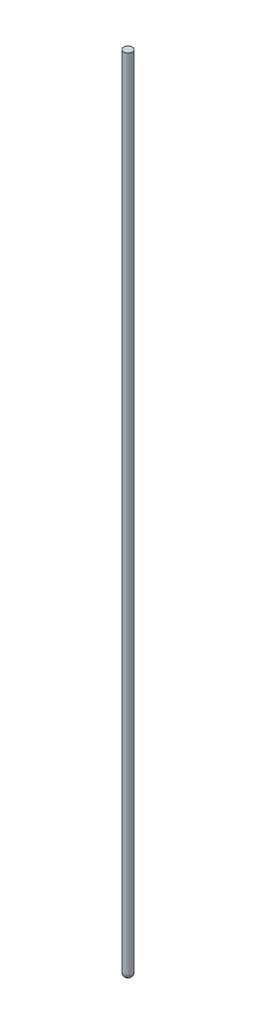
ISO-10303-21;
HEADER;
FILE_DESCRIPTION(('STEP AP214'),'2;1');
FILE_NAME('part.step','',(''),(''),'','','');
FILE_SCHEMA(('AUTOMOTIVE_DESIGN { 1 0 10303 214 1 1 1 1 }'));
ENDSEC;
DATA;
#1=APPLICATION_CONTEXT('core data for automotive mechanical design processes');
#2=APPLICATION_PROTOCOL_DEFINITION('international standard','automotive_design',2000,#1);
#3=PRODUCT_CONTEXT('',#1,'mechanical');
#4=PRODUCT('Part','Part','',(#3));
#5=PRODUCT_RELATED_PRODUCT_CATEGORY('part','',(#4));
#6=PRODUCT_DEFINITION_FORMATION('','',#4);
#7=PRODUCT_DEFINITION_CONTEXT('part definition',#1,'design');
#8=PRODUCT_DEFINITION('design','',#6,#7);
#9=PRODUCT_DEFINITION_SHAPE('','',#8);
#10=(LENGTH_UNIT() NAMED_UNIT(*) SI_UNIT(.MILLI.,.METRE.));
#11=(NAMED_UNIT(*) PLANE_ANGLE_UNIT() SI_UNIT($,.RADIAN.));
#12=(NAMED_UNIT(*) SI_UNIT($,.STERADIAN.) SOLID_ANGLE_UNIT());
#13=UNCERTAINTY_MEASURE_WITH_UNIT(LENGTH_MEASURE(1.E-05),#10,'distance_accuracy_value','');
#14=(GEOMETRIC_REPRESENTATION_CONTEXT(3) GLOBAL_UNCERTAINTY_ASSIGNED_CONTEXT((#13)) GLOBAL_UNIT_ASSIGNED_CONTEXT((#10,
#11,#12)) REPRESENTATION_CONTEXT('',''));
#15=CARTESIAN_POINT('',(0.,0.,0.));
#16=DIRECTION('',(0.,0.,1.));
#17=DIRECTION('',(1.,0.,0.));
#18=AXIS2_PLACEMENT_3D('',#15,#16,#17);
#19=CARTESIAN_POINT('',(8.88178419700125E-13,934.720000000001,1.33226762955019E-12));
#20=DIRECTION('',(0.,-1.,0.));
#21=DIRECTION('',(0.,0.,-1.));
#22=AXIS2_PLACEMENT_3D('',#19,#20,#21);
#23=CYLINDRICAL_SURFACE('',#22,5.08);
#24=CARTESIAN_POINT('',(0.,4.95299999999121,0.));
#25=DIRECTION('',(0.,1.,0.));
#26=DIRECTION('',(0.,0.,1.));
#27=AXIS2_PLACEMENT_3D('',#24,#25,#26);
#28=CIRCLE('',#27,5.08);
#29=CARTESIAN_POINT('',(0.,4.95299999999122,5.08000000000007));
#30=VERTEX_POINT('',#29);
#31=EDGE_CURVE('E67',#30,#30,#28,.T.);
#32=ORIENTED_EDGE('',*,*,#31,.T.);
#33=EDGE_LOOP('',(#32));
#34=FACE_BOUND('',#33,.T.);
#35=CARTESIAN_POINT('',(8.88178419700125E-13,934.720000000001,1.33226762955019E-12));
#36=DIRECTION('',(0.,1.,0.));
#37=DIRECTION('',(0.,0.,1.));
#38=AXIS2_PLACEMENT_3D('',#35,#36,#37);
#39=CIRCLE('',#38,5.08);
#40=CARTESIAN_POINT('',(8.88742412996635E-13,934.720000000001,5.08000000000134));
#41=VERTEX_POINT('',#40);
#42=EDGE_CURVE('E71',#41,#41,#39,.T.);
#43=ORIENTED_EDGE('',*,*,#42,.F.);
#44=EDGE_LOOP('',(#43));
#45=FACE_BOUND('',#44,.T.);
#46=ADVANCED_FACE('F60',(#34,#45),#23,.T.);
#47=CARTESIAN_POINT('',(8.88178419700125E-13,934.720000000001,1.33226762955019E-12));
#48=DIRECTION('',(0.,1.,0.));
#49=DIRECTION('',(0.,0.,1.));
#50=AXIS2_PLACEMENT_3D('',#47,#48,#49);
#51=PLANE('',#50);
#52=ORIENTED_EDGE('',*,*,#42,.T.);
#53=EDGE_LOOP('',(#52));
#54=FACE_BOUND('',#53,.T.);
#55=ADVANCED_FACE('F78',(#54),#51,.T.);
#56=CARTESIAN_POINT('',(0.,0.,0.));
#57=DIRECTION('',(0.,1.,0.));
#58=DIRECTION('',(0.,0.,1.));
#59=AXIS2_PLACEMENT_3D('',#56,#57,#58);
#60=PLANE('',#59);
#61=CARTESIAN_POINT('',(0.,0.,0.));
#62=DIRECTION('',(0.,1.,0.));
#63=DIRECTION('',(0.,0.,1.));
#64=AXIS2_PLACEMENT_3D('',#61,#62,#63);
#65=CIRCLE('',#64,0.127000000000002);
#66=CARTESIAN_POINT('',(0.,0.,0.127000000000002));
#67=VERTEX_POINT('',#66);
#68=EDGE_CURVE('E13',#67,#67,#65,.F.);
#69=ORIENTED_EDGE('',*,*,#68,.T.);
#70=EDGE_LOOP('',(#69));
#71=FACE_BOUND('',#70,.T.);
#72=ADVANCED_FACE('F84',(#71),#60,.F.);
#73=CARTESIAN_POINT('',(0.,4.95299999999999,0.));
#74=DIRECTION('',(0.,1.,0.));
#75=DIRECTION('',(0.,0.,1.));
#76=AXIS2_PLACEMENT_3D('',#73,#74,#75);
#77=DEGENERATE_TOROIDAL_SURFACE('',#76,0.127000000000002,4.953,.T.);
#78=ORIENTED_EDGE('',*,*,#68,.F.);
#79=EDGE_LOOP('',(#78));
#80=FACE_BOUND('',#79,.T.);
#81=ORIENTED_EDGE('',*,*,#31,.F.);
#82=EDGE_LOOP('',(#81));
#83=FACE_BOUND('',#82,.T.);
#84=ADVANCED_FACE('F62',(#80,#83),#77,.T.);
#85=CLOSED_SHELL('',(#46,#55,#72,#84));
#86=MANIFOLD_SOLID_BREP('B2',#85);
#87=ADVANCED_BREP_SHAPE_REPRESENTATION('',(#18,#86),#14);
#88=SHAPE_DEFINITION_REPRESENTATION(#9,#87);
ENDSEC;
END-ISO-10303-21;
